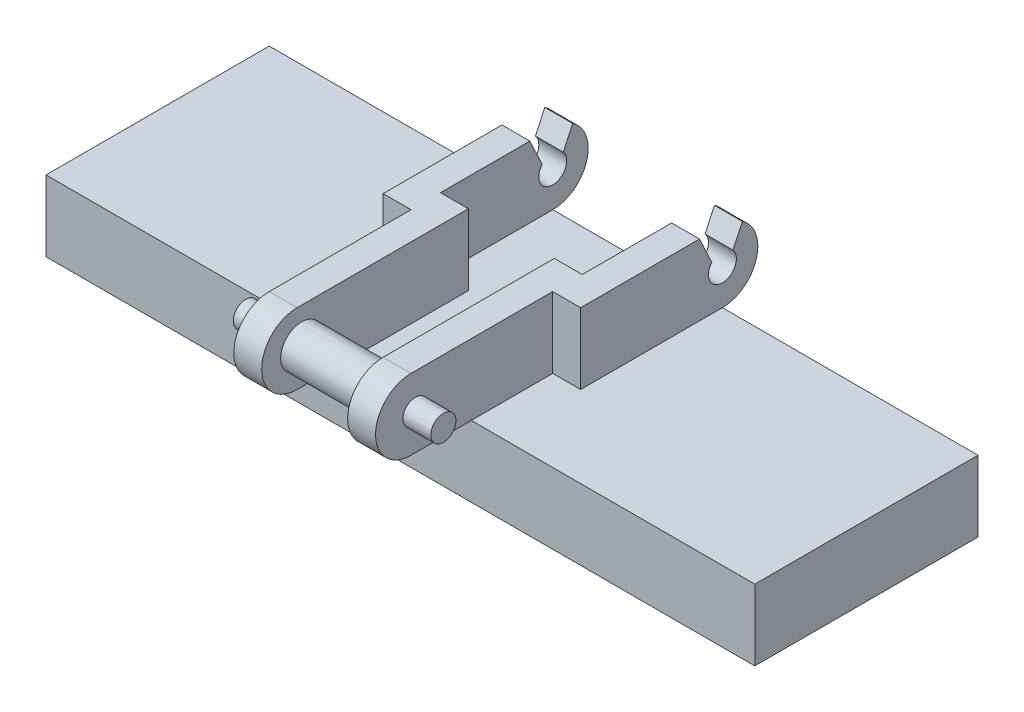
ISO-10303-21;
HEADER;
FILE_DESCRIPTION(('STEP AP214'),'2;1');
FILE_NAME('part.step','',(''),(''),'','','');
FILE_SCHEMA(('AUTOMOTIVE_DESIGN { 1 0 10303 214 1 1 1 1 }'));
ENDSEC;
DATA;
#1=APPLICATION_CONTEXT('core data for automotive mechanical design processes');
#2=APPLICATION_PROTOCOL_DEFINITION('international standard','automotive_design',2000,#1);
#3=PRODUCT_CONTEXT('',#1,'mechanical');
#4=PRODUCT('Part','Part','',(#3));
#5=PRODUCT_RELATED_PRODUCT_CATEGORY('part','',(#4));
#6=PRODUCT_DEFINITION_FORMATION('','',#4);
#7=PRODUCT_DEFINITION_CONTEXT('part definition',#1,'design');
#8=PRODUCT_DEFINITION('design','',#6,#7);
#9=PRODUCT_DEFINITION_SHAPE('','',#8);
#10=(LENGTH_UNIT() NAMED_UNIT(*) SI_UNIT(.MILLI.,.METRE.));
#11=(NAMED_UNIT(*) PLANE_ANGLE_UNIT() SI_UNIT($,.RADIAN.));
#12=(NAMED_UNIT(*) SI_UNIT($,.STERADIAN.) SOLID_ANGLE_UNIT());
#13=UNCERTAINTY_MEASURE_WITH_UNIT(LENGTH_MEASURE(1.E-05),#10,'distance_accuracy_value','');
#14=(GEOMETRIC_REPRESENTATION_CONTEXT(3) GLOBAL_UNCERTAINTY_ASSIGNED_CONTEXT((#13)) GLOBAL_UNIT_ASSIGNED_CONTEXT((#10,
#11,#12)) REPRESENTATION_CONTEXT('',''));
#15=CARTESIAN_POINT('',(0.,0.,0.));
#16=DIRECTION('',(0.,0.,1.));
#17=DIRECTION('',(1.,0.,0.));
#18=AXIS2_PLACEMENT_3D('',#15,#16,#17);
#19=CARTESIAN_POINT('',(-3.54,5.08,-2.54));
#20=DIRECTION('',(1.,0.,0.));
#21=DIRECTION('',(0.,0.,-1.));
#22=AXIS2_PLACEMENT_3D('',#19,#20,#21);
#23=PLANE('',#22);
#24=DIRECTION('',(0.,0.,1.));
#25=VECTOR('',#24,1.);
#26=CARTESIAN_POINT('',(-3.54,5.08,-2.54));
#27=LINE('',#26,#25);
#28=CARTESIAN_POINT('',(-3.54,5.08,-1.72030075043139));
#29=VERTEX_POINT('',#28);
#30=CARTESIAN_POINT('',(-3.54,5.08,2.54));
#31=VERTEX_POINT('',#30);
#32=EDGE_CURVE('E298',#29,#31,#27,.T.);
#33=ORIENTED_EDGE('',*,*,#32,.F.);
#34=DIRECTION('',(0.,-0.905890563934801,-0.423511848917937));
#35=VECTOR('',#34,1.);
#36=CARTESIAN_POINT('',(-3.54,4.76551796665088,-1.86732388180904));
#37=LINE('',#36,#35);
#38=CARTESIAN_POINT('',(-3.54,4.13655586890109,-2.16136922406353));
#39=VERTEX_POINT('',#38);
#40=EDGE_CURVE('E483',#29,#39,#37,.T.);
#41=ORIENTED_EDGE('',*,*,#40,.T.);
#42=CARTESIAN_POINT('',(-3.54,3.81,-2.54));
#43=DIRECTION('',(1.,0.,0.));
#44=DIRECTION('',(0.,0.,-1.));
#45=AXIS2_PLACEMENT_3D('',#42,#43,#44);
#46=CIRCLE('',#45,0.5);
#47=CARTESIAN_POINT('',(-3.54,4.13655586890108,-2.91863077593648));
#48=VERTEX_POINT('',#47);
#49=EDGE_CURVE('E503',#39,#48,#46,.T.);
#50=ORIENTED_EDGE('',*,*,#49,.T.);
#51=DIRECTION('',(0.,0.905890563934803,-0.423511848917932));
#52=VECTOR('',#51,1.);
#53=CARTESIAN_POINT('',(-3.54,4.76551796665089,-3.21267611819097));
#54=LINE('',#53,#52);
#55=CARTESIAN_POINT('',(-3.54,4.85874670048721,-3.25626137562847));
#56=VERTEX_POINT('',#55);
#57=EDGE_CURVE('E491',#48,#56,#54,.T.);
#58=ORIENTED_EDGE('',*,*,#57,.T.);
#59=CARTESIAN_POINT('',(-3.54,3.81,-2.54));
#60=DIRECTION('',(1.,0.,0.));
#61=DIRECTION('',(0.,0.,-1.));
#62=AXIS2_PLACEMENT_3D('',#59,#60,#61);
#63=CIRCLE('',#62,1.27);
#64=CARTESIAN_POINT('',(-3.54,2.54,-2.54));
#65=VERTEX_POINT('',#64);
#66=EDGE_CURVE('E283',#65,#56,#63,.T.);
#67=ORIENTED_EDGE('',*,*,#66,.F.);
#68=DIRECTION('',(0.,0.,1.));
#69=VECTOR('',#68,1.);
#70=CARTESIAN_POINT('',(-3.54,2.54,-2.54));
#71=LINE('',#70,#69);
#72=CARTESIAN_POINT('',(-3.54,2.54,2.54));
#73=VERTEX_POINT('',#72);
#74=EDGE_CURVE('E297',#65,#73,#71,.T.);
#75=ORIENTED_EDGE('',*,*,#74,.T.);
#76=DIRECTION('',(0.,-1.,0.));
#77=VECTOR('',#76,1.);
#78=CARTESIAN_POINT('',(-3.54,5.08,2.54));
#79=LINE('',#78,#77);
#80=EDGE_CURVE('E340',#31,#73,#79,.T.);
#81=ORIENTED_EDGE('',*,*,#80,.F.);
#82=EDGE_LOOP('',(#33,#41,#50,#58,#67,#75,#81));
#83=FACE_BOUND('',#82,.T.);
#84=ADVANCED_FACE('F36',(#83),#23,.F.);
#85=CARTESIAN_POINT('',(-2.54,5.08,1.48274251366495));
#86=DIRECTION('',(-1.,0.,0.));
#87=DIRECTION('',(0.,0.,1.));
#88=AXIS2_PLACEMENT_3D('',#85,#86,#87);
#89=PLANE('',#88);
#90=DIRECTION('',(0.,0.905890563934801,0.423511848917937));
#91=VECTOR('',#90,1.);
#92=CARTESIAN_POINT('',(-2.54,6.30886480514449,-1.1457955878692));
#93=LINE('',#92,#91);
#94=CARTESIAN_POINT('',(-2.54,4.13655586890109,-2.16136922406353));
#95=VERTEX_POINT('',#94);
#96=CARTESIAN_POINT('',(-2.54,5.08,-1.72030075043139));
#97=VERTEX_POINT('',#96);
#98=EDGE_CURVE('E479',#95,#97,#93,.T.);
#99=ORIENTED_EDGE('',*,*,#98,.T.);
#100=DIRECTION('',(0.,0.,-1.));
#101=VECTOR('',#100,1.);
#102=CARTESIAN_POINT('',(-2.54,5.08,1.48274251366495));
#103=LINE('',#102,#101);
#104=CARTESIAN_POINT('',(-2.54,5.08,1.48274251366495));
#105=VERTEX_POINT('',#104);
#106=EDGE_CURVE('E313',#105,#97,#103,.T.);
#107=ORIENTED_EDGE('',*,*,#106,.F.);
#108=DIRECTION('',(0.,-1.,0.));
#109=VECTOR('',#108,1.);
#110=CARTESIAN_POINT('',(-2.54,5.08,1.48274251366495));
#111=LINE('',#110,#109);
#112=CARTESIAN_POINT('',(-2.54,2.54,1.48274251366495));
#113=VERTEX_POINT('',#112);
#114=EDGE_CURVE('E316',#105,#113,#111,.T.);
#115=ORIENTED_EDGE('',*,*,#114,.T.);
#116=DIRECTION('',(0.,0.,-1.));
#117=VECTOR('',#116,1.);
#118=CARTESIAN_POINT('',(-2.54,2.54,1.48274251366495));
#119=LINE('',#118,#117);
#120=CARTESIAN_POINT('',(-2.54,2.54,-2.54));
#121=VERTEX_POINT('',#120);
#122=EDGE_CURVE('E301',#113,#121,#119,.T.);
#123=ORIENTED_EDGE('',*,*,#122,.T.);
#124=CARTESIAN_POINT('',(-2.54,3.81,-2.54));
#125=DIRECTION('',(-1.,0.,0.));
#126=DIRECTION('',(0.,0.,1.));
#127=AXIS2_PLACEMENT_3D('',#124,#125,#126);
#128=CIRCLE('',#127,1.27);
#129=CARTESIAN_POINT('',(-2.54,4.85874670048721,-3.25626137562847));
#130=VERTEX_POINT('',#129);
#131=EDGE_CURVE('E282',#130,#121,#128,.T.);
#132=ORIENTED_EDGE('',*,*,#131,.F.);
#133=DIRECTION('',(0.,-0.905890563934803,0.423511848917932));
#134=VECTOR('',#133,1.);
#135=CARTESIAN_POINT('',(-2.54,3.22217112815729,-2.49114782425114));
#136=LINE('',#135,#134);
#137=CARTESIAN_POINT('',(-2.54,4.13655586890108,-2.91863077593648));
#138=VERTEX_POINT('',#137);
#139=EDGE_CURVE('E488',#130,#138,#136,.T.);
#140=ORIENTED_EDGE('',*,*,#139,.T.);
#141=CARTESIAN_POINT('',(-2.54,3.81,-2.54));
#142=DIRECTION('',(-1.,0.,0.));
#143=DIRECTION('',(0.,0.,1.));
#144=AXIS2_PLACEMENT_3D('',#141,#142,#143);
#145=CIRCLE('',#144,0.5);
#146=EDGE_CURVE('E501',#138,#95,#145,.T.);
#147=ORIENTED_EDGE('',*,*,#146,.T.);
#148=EDGE_LOOP('',(#99,#107,#115,#123,#132,#140,#147));
#149=FACE_BOUND('',#148,.T.);
#150=ADVANCED_FACE('F550',(#149),#89,.F.);
#151=CARTESIAN_POINT('',(0.,5.08,0.));
#152=DIRECTION('',(0.,1.,0.));
#153=DIRECTION('',(0.,0.,1.));
#154=AXIS2_PLACEMENT_3D('',#151,#152,#153);
#155=PLANE('',#154);
#156=ORIENTED_EDGE('',*,*,#106,.T.);
#157=DIRECTION('',(1.,0.,0.));
#158=VECTOR('',#157,1.);
#159=CARTESIAN_POINT('',(-5.46,5.08,-1.72030075043139));
#160=LINE('',#159,#158);
#161=EDGE_CURVE('E241',#29,#97,#160,.T.);
#162=ORIENTED_EDGE('',*,*,#161,.F.);
#163=ORIENTED_EDGE('',*,*,#32,.T.);
#164=DIRECTION('',(1.,0.,0.));
#165=VECTOR('',#164,1.);
#166=CARTESIAN_POINT('',(-3.54,5.08,2.54));
#167=LINE('',#166,#165);
#168=CARTESIAN_POINT('',(-2.54,5.08,2.54));
#169=VERTEX_POINT('',#168);
#170=EDGE_CURVE('E300',#31,#169,#167,.T.);
#171=ORIENTED_EDGE('',*,*,#170,.T.);
#172=DIRECTION('',(0.,0.,1.));
#173=VECTOR('',#172,1.);
#174=CARTESIAN_POINT('',(-2.54,5.08,2.54));
#175=LINE('',#174,#173);
#176=CARTESIAN_POINT('',(-2.54,5.08,7.62));
#177=VERTEX_POINT('',#176);
#178=EDGE_CURVE('E303',#169,#177,#175,.T.);
#179=ORIENTED_EDGE('',*,*,#178,.T.);
#180=DIRECTION('',(1.,0.,0.));
#181=VECTOR('',#180,1.);
#182=CARTESIAN_POINT('',(-2.54,5.08,7.62));
#183=LINE('',#182,#181);
#184=CARTESIAN_POINT('',(-1.54,5.08,7.62));
#185=VERTEX_POINT('',#184);
#186=EDGE_CURVE('E306',#177,#185,#183,.T.);
#187=ORIENTED_EDGE('',*,*,#186,.T.);
#188=DIRECTION('',(0.,0.,-1.));
#189=VECTOR('',#188,1.);
#190=CARTESIAN_POINT('',(-1.54,5.08,7.62));
#191=LINE('',#190,#189);
#192=CARTESIAN_POINT('',(-1.54,5.08,1.48274251366495));
#193=VERTEX_POINT('',#192);
#194=EDGE_CURVE('E309',#185,#193,#191,.T.);
#195=ORIENTED_EDGE('',*,*,#194,.T.);
#196=DIRECTION('',(-1.,0.,0.));
#197=VECTOR('',#196,1.);
#198=CARTESIAN_POINT('',(-1.54,5.08,1.48274251366495));
#199=LINE('',#198,#197);
#200=EDGE_CURVE('E311',#193,#105,#199,.T.);
#201=ORIENTED_EDGE('',*,*,#200,.T.);
#202=EDGE_LOOP('',(#156,#162,#163,#171,#179,#187,#195,#201));
#203=FACE_BOUND('',#202,.T.);
#204=ADVANCED_FACE('F386',(#203),#155,.T.);
#205=CARTESIAN_POINT('',(2.54,5.08,1.48274251366495));
#206=DIRECTION('',(-1.,0.,0.));
#207=DIRECTION('',(0.,0.,1.));
#208=AXIS2_PLACEMENT_3D('',#205,#206,#207);
#209=PLANE('',#208);
#210=DIRECTION('',(0.,0.,-1.));
#211=VECTOR('',#210,1.);
#212=CARTESIAN_POINT('',(2.54,5.08,1.48274251366495));
#213=LINE('',#212,#211);
#214=CARTESIAN_POINT('',(2.54,5.08,1.48274251366495));
#215=VERTEX_POINT('',#214);
#216=CARTESIAN_POINT('',(2.54,5.08,-1.72030075043139));
#217=VERTEX_POINT('',#216);
#218=EDGE_CURVE('E273',#215,#217,#213,.T.);
#219=ORIENTED_EDGE('',*,*,#218,.T.);
#220=DIRECTION('',(0.,0.905890563934801,0.423511848917937));
#221=VECTOR('',#220,1.);
#222=CARTESIAN_POINT('',(2.54,6.30886480514449,-1.1457955878692));
#223=LINE('',#222,#221);
#224=CARTESIAN_POINT('',(2.54,4.13655586890109,-2.16136922406353));
#225=VERTEX_POINT('',#224);
#226=EDGE_CURVE('E237',#225,#217,#223,.T.);
#227=ORIENTED_EDGE('',*,*,#226,.F.);
#228=CARTESIAN_POINT('',(2.54,3.81,-2.54));
#229=DIRECTION('',(-1.,0.,0.));
#230=DIRECTION('',(0.,0.,1.));
#231=AXIS2_PLACEMENT_3D('',#228,#229,#230);
#232=CIRCLE('',#231,0.5);
#233=CARTESIAN_POINT('',(2.54,4.13655586890108,-2.91863077593648));
#234=VERTEX_POINT('',#233);
#235=EDGE_CURVE('E498',#234,#225,#232,.T.);
#236=ORIENTED_EDGE('',*,*,#235,.F.);
#237=DIRECTION('',(0.,-0.905890563934803,0.423511848917932));
#238=VECTOR('',#237,1.);
#239=CARTESIAN_POINT('',(2.54,3.22217112815729,-2.49114782425114));
#240=LINE('',#239,#238);
#241=CARTESIAN_POINT('',(2.54,4.85874670048721,-3.25626137562847));
#242=VERTEX_POINT('',#241);
#243=EDGE_CURVE('E61',#242,#234,#240,.T.);
#244=ORIENTED_EDGE('',*,*,#243,.F.);
#245=CARTESIAN_POINT('',(2.54,3.81,-2.54));
#246=DIRECTION('',(-1.,0.,0.));
#247=DIRECTION('',(0.,0.,1.));
#248=AXIS2_PLACEMENT_3D('',#245,#246,#247);
#249=CIRCLE('',#248,1.27);
#250=CARTESIAN_POINT('',(2.54,2.54,-2.54));
#251=VERTEX_POINT('',#250);
#252=EDGE_CURVE('E434',#242,#251,#249,.T.);
#253=ORIENTED_EDGE('',*,*,#252,.T.);
#254=DIRECTION('',(0.,0.,-1.));
#255=VECTOR('',#254,1.);
#256=CARTESIAN_POINT('',(2.54,2.54,1.48274251366495));
#257=LINE('',#256,#255);
#258=CARTESIAN_POINT('',(2.54,2.54,1.48274251366495));
#259=VERTEX_POINT('',#258);
#260=EDGE_CURVE('E256',#259,#251,#257,.T.);
#261=ORIENTED_EDGE('',*,*,#260,.F.);
#262=DIRECTION('',(0.,-1.,0.));
#263=VECTOR('',#262,1.);
#264=CARTESIAN_POINT('',(2.54,5.08,1.48274251366495));
#265=LINE('',#264,#263);
#266=EDGE_CURVE('E279',#215,#259,#265,.T.);
#267=ORIENTED_EDGE('',*,*,#266,.F.);
#268=EDGE_LOOP('',(#219,#227,#236,#244,#253,#261,#267));
#269=FACE_BOUND('',#268,.T.);
#270=ADVANCED_FACE('F615',(#269),#209,.T.);
#271=CARTESIAN_POINT('',(3.54,5.08,-2.54));
#272=DIRECTION('',(1.,0.,0.));
#273=DIRECTION('',(0.,0.,-1.));
#274=AXIS2_PLACEMENT_3D('',#271,#272,#273);
#275=PLANE('',#274);
#276=DIRECTION('',(0.,-0.905890563934801,-0.423511848917937));
#277=VECTOR('',#276,1.);
#278=CARTESIAN_POINT('',(3.54,5.08,-1.72030075043139));
#279=LINE('',#278,#277);
#280=CARTESIAN_POINT('',(3.54,5.08,-1.72030075043139));
#281=VERTEX_POINT('',#280);
#282=CARTESIAN_POINT('',(3.54,4.13655586890109,-2.16136922406353));
#283=VERTEX_POINT('',#282);
#284=EDGE_CURVE('E53',#281,#283,#279,.T.);
#285=ORIENTED_EDGE('',*,*,#284,.F.);
#286=DIRECTION('',(0.,0.,1.));
#287=VECTOR('',#286,1.);
#288=CARTESIAN_POINT('',(3.54,5.08,-2.54));
#289=LINE('',#288,#287);
#290=CARTESIAN_POINT('',(3.54,5.08,2.54));
#291=VERTEX_POINT('',#290);
#292=EDGE_CURVE('E225',#281,#291,#289,.T.);
#293=ORIENTED_EDGE('',*,*,#292,.T.);
#294=DIRECTION('',(0.,-1.,0.));
#295=VECTOR('',#294,1.);
#296=CARTESIAN_POINT('',(3.54,5.08,2.54));
#297=LINE('',#296,#295);
#298=CARTESIAN_POINT('',(3.54,2.54,2.54));
#299=VERTEX_POINT('',#298);
#300=EDGE_CURVE('E248',#291,#299,#297,.T.);
#301=ORIENTED_EDGE('',*,*,#300,.T.);
#302=DIRECTION('',(0.,0.,1.));
#303=VECTOR('',#302,1.);
#304=CARTESIAN_POINT('',(3.54,2.54,-2.54));
#305=LINE('',#304,#303);
#306=CARTESIAN_POINT('',(3.54,2.54,-2.54));
#307=VERTEX_POINT('',#306);
#308=EDGE_CURVE('E272',#307,#299,#305,.T.);
#309=ORIENTED_EDGE('',*,*,#308,.F.);
#310=CARTESIAN_POINT('',(3.54,3.81,-2.54));
#311=DIRECTION('',(-1.,0.,0.));
#312=DIRECTION('',(0.,0.,1.));
#313=AXIS2_PLACEMENT_3D('',#310,#311,#312);
#314=CIRCLE('',#313,1.27);
#315=CARTESIAN_POINT('',(3.54,4.85874670048721,-3.25626137562847));
#316=VERTEX_POINT('',#315);
#317=EDGE_CURVE('E429',#307,#316,#314,.F.);
#318=ORIENTED_EDGE('',*,*,#317,.T.);
#319=DIRECTION('',(0.,0.905890563934802,-0.423511848917932));
#320=VECTOR('',#319,1.);
#321=CARTESIAN_POINT('',(3.54,4.85874670048721,-3.25626137562847));
#322=LINE('',#321,#320);
#323=CARTESIAN_POINT('',(3.54,4.13655586890108,-2.91863077593648));
#324=VERTEX_POINT('',#323);
#325=EDGE_CURVE('E230',#324,#316,#322,.T.);
#326=ORIENTED_EDGE('',*,*,#325,.F.);
#327=CARTESIAN_POINT('',(3.54,3.81,-2.54));
#328=DIRECTION('',(1.,0.,0.));
#329=DIRECTION('',(0.,0.,-1.));
#330=AXIS2_PLACEMENT_3D('',#327,#328,#329);
#331=CIRCLE('',#330,0.5);
#332=EDGE_CURVE('E229',#283,#324,#331,.T.);
#333=ORIENTED_EDGE('',*,*,#332,.F.);
#334=EDGE_LOOP('',(#285,#293,#301,#309,#318,#326,#333));
#335=FACE_BOUND('',#334,.T.);
#336=ADVANCED_FACE('F222',(#335),#275,.T.);
#337=CARTESIAN_POINT('',(0.,5.08,0.));
#338=DIRECTION('',(0.,1.,0.));
#339=DIRECTION('',(0.,0.,1.));
#340=AXIS2_PLACEMENT_3D('',#337,#338,#339);
#341=PLANE('',#340);
#342=ORIENTED_EDGE('',*,*,#292,.F.);
#343=EDGE_CURVE('E234',#217,#281,#160,.T.);
#344=ORIENTED_EDGE('',*,*,#343,.F.);
#345=ORIENTED_EDGE('',*,*,#218,.F.);
#346=DIRECTION('',(1.,0.,0.));
#347=VECTOR('',#346,1.);
#348=CARTESIAN_POINT('',(1.54,5.08,1.48274251366495));
#349=LINE('',#348,#347);
#350=CARTESIAN_POINT('',(1.54,5.08,1.48274251366495));
#351=VERTEX_POINT('',#350);
#352=EDGE_CURVE('E444',#351,#215,#349,.T.);
#353=ORIENTED_EDGE('',*,*,#352,.F.);
#354=DIRECTION('',(0.,0.,-1.));
#355=VECTOR('',#354,1.);
#356=CARTESIAN_POINT('',(1.54,5.08,7.62));
#357=LINE('',#356,#355);
#358=CARTESIAN_POINT('',(1.54,5.08,7.62));
#359=VERTEX_POINT('',#358);
#360=EDGE_CURVE('E447',#359,#351,#357,.T.);
#361=ORIENTED_EDGE('',*,*,#360,.F.);
#362=DIRECTION('',(-1.,0.,0.));
#363=VECTOR('',#362,1.);
#364=CARTESIAN_POINT('',(2.54,5.08,7.62));
#365=LINE('',#364,#363);
#366=CARTESIAN_POINT('',(2.54,5.08,7.62));
#367=VERTEX_POINT('',#366);
#368=EDGE_CURVE('E450',#367,#359,#365,.T.);
#369=ORIENTED_EDGE('',*,*,#368,.F.);
#370=DIRECTION('',(0.,0.,1.));
#371=VECTOR('',#370,1.);
#372=CARTESIAN_POINT('',(2.54,5.08,2.54));
#373=LINE('',#372,#371);
#374=CARTESIAN_POINT('',(2.54,5.08,2.54));
#375=VERTEX_POINT('',#374);
#376=EDGE_CURVE('E252',#375,#367,#373,.T.);
#377=ORIENTED_EDGE('',*,*,#376,.F.);
#378=DIRECTION('',(-1.,0.,0.));
#379=VECTOR('',#378,1.);
#380=CARTESIAN_POINT('',(3.54,5.08,2.54));
#381=LINE('',#380,#379);
#382=EDGE_CURVE('E247',#291,#375,#381,.T.);
#383=ORIENTED_EDGE('',*,*,#382,.F.);
#384=EDGE_LOOP('',(#342,#344,#345,#353,#361,#369,#377,#383));
#385=FACE_BOUND('',#384,.T.);
#386=ADVANCED_FACE('F244',(#385),#341,.T.);
#387=CARTESIAN_POINT('',(-7.,5.08,-1.72030075043139));
#388=DIRECTION('',(0.,-0.423511848917937,0.905890563934801));
#389=DIRECTION('',(0.,-0.905890563934801,-0.423511848917937));
#390=AXIS2_PLACEMENT_3D('',#387,#388,#389);
#391=PLANE('',#390);
#392=ORIENTED_EDGE('',*,*,#226,.T.);
#393=ORIENTED_EDGE('',*,*,#343,.T.);
#394=ORIENTED_EDGE('',*,*,#284,.T.);
#395=DIRECTION('',(1.,0.,0.));
#396=VECTOR('',#395,1.);
#397=CARTESIAN_POINT('',(-12.7,4.13655586890109,-2.16136922406353));
#398=LINE('',#397,#396);
#399=EDGE_CURVE('E485',#225,#283,#398,.T.);
#400=ORIENTED_EDGE('',*,*,#399,.F.);
#401=EDGE_LOOP('',(#392,#393,#394,#400));
#402=FACE_BOUND('',#401,.T.);
#403=ADVANCED_FACE('F235',(#402),#391,.F.);
#404=CARTESIAN_POINT('',(-12.7,2.54,2.54));
#405=DIRECTION('',(0.,0.,-1.));
#406=DIRECTION('',(-1.,0.,0.));
#407=AXIS2_PLACEMENT_3D('',#404,#405,#406);
#408=PLANE('',#407);
#409=DIRECTION('',(-1.,0.,0.));
#410=VECTOR('',#409,1.);
#411=CARTESIAN_POINT('',(-12.7,2.54,2.54));
#412=LINE('',#411,#410);
#413=CARTESIAN_POINT('',(2.54,2.54,2.54));
#414=VERTEX_POINT('',#413);
#415=EDGE_CURVE('E425',#299,#414,#412,.T.);
#416=ORIENTED_EDGE('',*,*,#415,.F.);
#417=ORIENTED_EDGE('',*,*,#300,.F.);
#418=ORIENTED_EDGE('',*,*,#382,.T.);
#419=DIRECTION('',(0.,-1.,0.));
#420=VECTOR('',#419,1.);
#421=CARTESIAN_POINT('',(2.54,5.08,2.54));
#422=LINE('',#421,#420);
#423=EDGE_CURVE('E250',#375,#414,#422,.T.);
#424=ORIENTED_EDGE('',*,*,#423,.T.);
#425=EDGE_LOOP('',(#416,#417,#418,#424));
#426=FACE_BOUND('',#425,.T.);
#427=ADVANCED_FACE('F469',(#426),#408,.F.);
#428=CARTESIAN_POINT('',(-2.54,2.54,2.54));
#429=VERTEX_POINT('',#428);
#430=EDGE_CURVE('E428',#429,#73,#412,.T.);
#431=ORIENTED_EDGE('',*,*,#430,.F.);
#432=DIRECTION('',(0.,-1.,0.));
#433=VECTOR('',#432,1.);
#434=CARTESIAN_POINT('',(-2.54,5.08,2.54));
#435=LINE('',#434,#433);
#436=EDGE_CURVE('E337',#169,#429,#435,.T.);
#437=ORIENTED_EDGE('',*,*,#436,.F.);
#438=ORIENTED_EDGE('',*,*,#170,.F.);
#439=ORIENTED_EDGE('',*,*,#80,.T.);
#440=EDGE_LOOP('',(#431,#437,#438,#439));
#441=FACE_BOUND('',#440,.T.);
#442=ADVANCED_FACE('F536',(#441),#408,.F.);
#443=CARTESIAN_POINT('',(0.,2.54,0.));
#444=DIRECTION('',(0.,1.,0.));
#445=DIRECTION('',(0.,0.,1.));
#446=AXIS2_PLACEMENT_3D('',#443,#444,#445);
#447=PLANE('',#446);
#448=DIRECTION('',(-1.,0.,0.));
#449=VECTOR('',#448,1.);
#450=CARTESIAN_POINT('',(12.7,2.54,5.46));
#451=LINE('',#450,#449);
#452=CARTESIAN_POINT('',(-1.54,2.54,5.46));
#453=VERTEX_POINT('',#452);
#454=CARTESIAN_POINT('',(-2.54,2.54,5.46));
#455=VERTEX_POINT('',#454);
#456=EDGE_CURVE('E400',#453,#455,#451,.T.);
#457=ORIENTED_EDGE('',*,*,#456,.F.);
#458=DIRECTION('',(0.,0.,-1.));
#459=VECTOR('',#458,1.);
#460=CARTESIAN_POINT('',(-1.54,2.54,7.62));
#461=LINE('',#460,#459);
#462=CARTESIAN_POINT('',(-1.54,2.54,7.62));
#463=VERTEX_POINT('',#462);
#464=EDGE_CURVE('E324',#463,#453,#461,.T.);
#465=ORIENTED_EDGE('',*,*,#464,.F.);
#466=DIRECTION('',(1.,0.,0.));
#467=VECTOR('',#466,1.);
#468=CARTESIAN_POINT('',(-2.54,2.54,7.62));
#469=LINE('',#468,#467);
#470=CARTESIAN_POINT('',(-2.54,2.54,7.62));
#471=VERTEX_POINT('',#470);
#472=EDGE_CURVE('E322',#471,#463,#469,.T.);
#473=ORIENTED_EDGE('',*,*,#472,.F.);
#474=DIRECTION('',(0.,0.,1.));
#475=VECTOR('',#474,1.);
#476=CARTESIAN_POINT('',(-2.54,2.54,2.54));
#477=LINE('',#476,#475);
#478=EDGE_CURVE('E318',#455,#471,#477,.T.);
#479=ORIENTED_EDGE('',*,*,#478,.F.);
#480=EDGE_LOOP('',(#457,#465,#473,#479));
#481=FACE_BOUND('',#480,.T.);
#482=ADVANCED_FACE('F398',(#481),#447,.F.);
#483=CARTESIAN_POINT('',(0.,2.54,0.));
#484=DIRECTION('',(0.,1.,0.));
#485=DIRECTION('',(0.,0.,1.));
#486=AXIS2_PLACEMENT_3D('',#483,#484,#485);
#487=PLANE('',#486);
#488=CARTESIAN_POINT('',(2.54,2.54,5.46));
#489=VERTEX_POINT('',#488);
#490=CARTESIAN_POINT('',(1.54,2.54,5.46));
#491=VERTEX_POINT('',#490);
#492=EDGE_CURVE('E410',#489,#491,#451,.T.);
#493=ORIENTED_EDGE('',*,*,#492,.F.);
#494=DIRECTION('',(0.,0.,1.));
#495=VECTOR('',#494,1.);
#496=CARTESIAN_POINT('',(2.54,2.54,2.54));
#497=LINE('',#496,#495);
#498=CARTESIAN_POINT('',(2.54,2.54,7.62));
#499=VERTEX_POINT('',#498);
#500=EDGE_CURVE('E268',#489,#499,#497,.T.);
#501=ORIENTED_EDGE('',*,*,#500,.T.);
#502=DIRECTION('',(-1.,0.,0.));
#503=VECTOR('',#502,1.);
#504=CARTESIAN_POINT('',(2.54,2.54,7.62));
#505=LINE('',#504,#503);
#506=CARTESIAN_POINT('',(1.54,2.54,7.62));
#507=VERTEX_POINT('',#506);
#508=EDGE_CURVE('E265',#499,#507,#505,.T.);
#509=ORIENTED_EDGE('',*,*,#508,.T.);
#510=DIRECTION('',(0.,0.,-1.));
#511=VECTOR('',#510,1.);
#512=CARTESIAN_POINT('',(1.54,2.54,7.62));
#513=LINE('',#512,#511);
#514=EDGE_CURVE('E262',#507,#491,#513,.T.);
#515=ORIENTED_EDGE('',*,*,#514,.T.);
#516=EDGE_LOOP('',(#493,#501,#509,#515));
#517=FACE_BOUND('',#516,.T.);
#518=ADVANCED_FACE('F462',(#517),#487,.F.);
#519=CARTESIAN_POINT('',(0.,2.54,0.));
#520=DIRECTION('',(0.,1.,0.));
#521=DIRECTION('',(0.,0.,1.));
#522=AXIS2_PLACEMENT_3D('',#519,#520,#521);
#523=PLANE('',#522);
#524=ORIENTED_EDGE('',*,*,#260,.T.);
#525=DIRECTION('',(-1.,0.,0.));
#526=VECTOR('',#525,1.);
#527=CARTESIAN_POINT('',(-12.7,2.54,-2.54));
#528=LINE('',#527,#526);
#529=EDGE_CURVE('E354',#251,#121,#528,.T.);
#530=ORIENTED_EDGE('',*,*,#529,.T.);
#531=ORIENTED_EDGE('',*,*,#122,.F.);
#532=DIRECTION('',(-1.,0.,0.));
#533=VECTOR('',#532,1.);
#534=CARTESIAN_POINT('',(-1.54,2.54,1.48274251366495));
#535=LINE('',#534,#533);
#536=CARTESIAN_POINT('',(-1.54,2.54,1.48274251366495));
#537=VERTEX_POINT('',#536);
#538=EDGE_CURVE('E327',#537,#113,#535,.T.);
#539=ORIENTED_EDGE('',*,*,#538,.F.);
#540=EDGE_CURVE('E328',#453,#537,#461,.T.);
#541=ORIENTED_EDGE('',*,*,#540,.F.);
#542=EDGE_CURVE('E405',#491,#453,#451,.T.);
#543=ORIENTED_EDGE('',*,*,#542,.F.);
#544=CARTESIAN_POINT('',(1.54,2.54,1.48274251366495));
#545=VERTEX_POINT('',#544);
#546=EDGE_CURVE('E261',#491,#545,#513,.T.);
#547=ORIENTED_EDGE('',*,*,#546,.T.);
#548=DIRECTION('',(1.,0.,0.));
#549=VECTOR('',#548,1.);
#550=CARTESIAN_POINT('',(1.54,2.54,1.48274251366495));
#551=LINE('',#550,#549);
#552=EDGE_CURVE('E258',#545,#259,#551,.T.);
#553=ORIENTED_EDGE('',*,*,#552,.T.);
#554=EDGE_LOOP('',(#524,#530,#531,#539,#541,#543,#547,#553));
#555=FACE_BOUND('',#554,.T.);
#556=ADVANCED_FACE('F575',(#555),#523,.T.);
#557=CARTESIAN_POINT('',(-12.7,2.54,-2.54));
#558=DIRECTION('',(0.,0.,1.));
#559=DIRECTION('',(1.,0.,0.));
#560=AXIS2_PLACEMENT_3D('',#557,#558,#559);
#561=PLANE('',#560);
#562=ORIENTED_EDGE('',*,*,#529,.F.);
#563=DIRECTION('',(-1.,0.,0.));
#564=VECTOR('',#563,1.);
#565=CARTESIAN_POINT('',(11.4598063314247,2.54,-2.54));
#566=LINE('',#565,#564);
#567=EDGE_CURVE('E433',#307,#251,#566,.T.);
#568=ORIENTED_EDGE('',*,*,#567,.F.);
#569=CARTESIAN_POINT('',(12.7,2.54,-2.54));
#570=VERTEX_POINT('',#569);
#571=EDGE_CURVE('E350',#570,#307,#528,.T.);
#572=ORIENTED_EDGE('',*,*,#571,.F.);
#573=DIRECTION('',(0.,-1.,0.));
#574=VECTOR('',#573,1.);
#575=CARTESIAN_POINT('',(12.7,2.54,-2.54));
#576=LINE('',#575,#574);
#577=CARTESIAN_POINT('',(12.7,0.,-2.54));
#578=VERTEX_POINT('',#577);
#579=EDGE_CURVE('E361',#570,#578,#576,.T.);
#580=ORIENTED_EDGE('',*,*,#579,.T.);
#581=DIRECTION('',(-1.,0.,0.));
#582=VECTOR('',#581,1.);
#583=CARTESIAN_POINT('',(-12.7,0.,-2.54));
#584=LINE('',#583,#582);
#585=CARTESIAN_POINT('',(-12.7,0.,-2.54));
#586=VERTEX_POINT('',#585);
#587=EDGE_CURVE('E347',#578,#586,#584,.T.);
#588=ORIENTED_EDGE('',*,*,#587,.T.);
#589=DIRECTION('',(0.,-1.,0.));
#590=VECTOR('',#589,1.);
#591=CARTESIAN_POINT('',(-12.7,2.54,-2.54));
#592=LINE('',#591,#590);
#593=CARTESIAN_POINT('',(-12.7,2.54,-2.54));
#594=VERTEX_POINT('',#593);
#595=EDGE_CURVE('E353',#594,#586,#592,.T.);
#596=ORIENTED_EDGE('',*,*,#595,.F.);
#597=EDGE_CURVE('E349',#65,#594,#528,.T.);
#598=ORIENTED_EDGE('',*,*,#597,.F.);
#599=DIRECTION('',(1.,0.,0.));
#600=VECTOR('',#599,1.);
#601=CARTESIAN_POINT('',(-6.37980633142473,2.54,-2.54));
#602=LINE('',#601,#600);
#603=EDGE_CURVE('E287',#65,#121,#602,.T.);
#604=ORIENTED_EDGE('',*,*,#603,.T.);
#605=EDGE_LOOP('',(#562,#568,#572,#580,#588,#596,#598,#604));
#606=FACE_BOUND('',#605,.T.);
#607=ADVANCED_FACE('F525',(#606),#561,.F.);
#608=ORIENTED_EDGE('',*,*,#308,.T.);
#609=ORIENTED_EDGE('',*,*,#415,.T.);
#610=EDGE_CURVE('E269',#414,#489,#497,.T.);
#611=ORIENTED_EDGE('',*,*,#610,.T.);
#612=CARTESIAN_POINT('',(12.7,2.54,5.46));
#613=VERTEX_POINT('',#612);
#614=EDGE_CURVE('E413',#613,#489,#451,.T.);
#615=ORIENTED_EDGE('',*,*,#614,.F.);
#616=DIRECTION('',(0.,0.,-1.));
#617=VECTOR('',#616,1.);
#618=CARTESIAN_POINT('',(12.7,2.54,-2.54));
#619=LINE('',#618,#617);
#620=EDGE_CURVE('E346',#613,#570,#619,.T.);
#621=ORIENTED_EDGE('',*,*,#620,.T.);
#622=ORIENTED_EDGE('',*,*,#571,.T.);
#623=EDGE_LOOP('',(#608,#609,#611,#615,#621,#622));
#624=FACE_BOUND('',#623,.T.);
#625=ADVANCED_FACE('F466',(#624),#523,.T.);
#626=CARTESIAN_POINT('',(-12.7,2.54,-2.54));
#627=DIRECTION('',(1.,0.,0.));
#628=DIRECTION('',(0.,0.,-1.));
#629=AXIS2_PLACEMENT_3D('',#626,#627,#628);
#630=PLANE('',#629);
#631=DIRECTION('',(0.,0.,1.));
#632=VECTOR('',#631,1.);
#633=CARTESIAN_POINT('',(-12.7,0.,-2.54));
#634=LINE('',#633,#632);
#635=CARTESIAN_POINT('',(-12.7,0.,5.46));
#636=VERTEX_POINT('',#635);
#637=EDGE_CURVE('E343',#586,#636,#634,.T.);
#638=ORIENTED_EDGE('',*,*,#637,.T.);
#639=DIRECTION('',(0.,1.,0.));
#640=VECTOR('',#639,1.);
#641=CARTESIAN_POINT('',(-12.7,0.,5.46));
#642=LINE('',#641,#640);
#643=CARTESIAN_POINT('',(-12.7,2.54,5.46));
#644=VERTEX_POINT('',#643);
#645=EDGE_CURVE('E419',#636,#644,#642,.T.);
#646=ORIENTED_EDGE('',*,*,#645,.T.);
#647=DIRECTION('',(0.,0.,1.));
#648=VECTOR('',#647,1.);
#649=CARTESIAN_POINT('',(-12.7,2.54,-2.54));
#650=LINE('',#649,#648);
#651=EDGE_CURVE('E344',#594,#644,#650,.T.);
#652=ORIENTED_EDGE('',*,*,#651,.F.);
#653=ORIENTED_EDGE('',*,*,#595,.T.);
#654=EDGE_LOOP('',(#638,#646,#652,#653));
#655=FACE_BOUND('',#654,.T.);
#656=ADVANCED_FACE('F38',(#655),#630,.F.);
#657=CARTESIAN_POINT('',(12.7,2.54,-2.54));
#658=DIRECTION('',(-1.,0.,0.));
#659=DIRECTION('',(0.,0.,1.));
#660=AXIS2_PLACEMENT_3D('',#657,#658,#659);
#661=PLANE('',#660);
#662=DIRECTION('',(0.,0.,-1.));
#663=VECTOR('',#662,1.);
#664=CARTESIAN_POINT('',(12.7,0.,-2.54));
#665=LINE('',#664,#663);
#666=CARTESIAN_POINT('',(12.7,0.,5.46));
#667=VERTEX_POINT('',#666);
#668=EDGE_CURVE('E356',#667,#578,#665,.T.);
#669=ORIENTED_EDGE('',*,*,#668,.T.);
#670=ORIENTED_EDGE('',*,*,#579,.F.);
#671=ORIENTED_EDGE('',*,*,#620,.F.);
#672=DIRECTION('',(0.,1.,0.));
#673=VECTOR('',#672,1.);
#674=CARTESIAN_POINT('',(12.7,0.,5.46));
#675=LINE('',#674,#673);
#676=EDGE_CURVE('E422',#667,#613,#675,.T.);
#677=ORIENTED_EDGE('',*,*,#676,.F.);
#678=EDGE_LOOP('',(#669,#670,#671,#677));
#679=FACE_BOUND('',#678,.T.);
#680=ADVANCED_FACE('F520',(#679),#661,.F.);
#681=ORIENTED_EDGE('',*,*,#74,.F.);
#682=ORIENTED_EDGE('',*,*,#597,.T.);
#683=ORIENTED_EDGE('',*,*,#651,.T.);
#684=EDGE_CURVE('E414',#455,#644,#451,.T.);
#685=ORIENTED_EDGE('',*,*,#684,.F.);
#686=EDGE_CURVE('E319',#429,#455,#477,.T.);
#687=ORIENTED_EDGE('',*,*,#686,.F.);
#688=ORIENTED_EDGE('',*,*,#430,.T.);
#689=EDGE_LOOP('',(#681,#682,#683,#685,#687,#688));
#690=FACE_BOUND('',#689,.T.);
#691=ADVANCED_FACE('F530',(#690),#523,.T.);
#692=CARTESIAN_POINT('',(0.,0.,0.));
#693=DIRECTION('',(0.,1.,0.));
#694=DIRECTION('',(0.,0.,1.));
#695=AXIS2_PLACEMENT_3D('',#692,#693,#694);
#696=PLANE('',#695);
#697=ORIENTED_EDGE('',*,*,#637,.F.);
#698=ORIENTED_EDGE('',*,*,#587,.F.);
#699=ORIENTED_EDGE('',*,*,#668,.F.);
#700=DIRECTION('',(-1.,0.,0.));
#701=VECTOR('',#700,1.);
#702=CARTESIAN_POINT('',(12.7,0.,5.46));
#703=LINE('',#702,#701);
#704=EDGE_CURVE('E417',#667,#636,#703,.T.);
#705=ORIENTED_EDGE('',*,*,#704,.T.);
#706=EDGE_LOOP('',(#697,#698,#699,#705));
#707=FACE_BOUND('',#706,.T.);
#708=ADVANCED_FACE('F517',(#707),#696,.F.);
#709=CARTESIAN_POINT('',(-2.54,5.08,2.54));
#710=DIRECTION('',(1.,0.,0.));
#711=DIRECTION('',(0.,0.,-1.));
#712=AXIS2_PLACEMENT_3D('',#709,#710,#711);
#713=PLANE('',#712);
#714=CARTESIAN_POINT('',(-2.54,3.81,7.46));
#715=DIRECTION('',(1.,0.,0.));
#716=DIRECTION('',(0.,0.,-1.));
#717=AXIS2_PLACEMENT_3D('',#714,#715,#716);
#718=CIRCLE('',#717,0.45);
#719=CARTESIAN_POINT('',(-2.54,3.81,7.01));
#720=VERTEX_POINT('',#719);
#721=EDGE_CURVE('E11',#720,#720,#718,.F.);
#722=ORIENTED_EDGE('',*,*,#721,.F.);
#723=EDGE_LOOP('',(#722));
#724=FACE_BOUND('',#723,.T.);
#725=ORIENTED_EDGE('',*,*,#686,.T.);
#726=ORIENTED_EDGE('',*,*,#478,.T.);
#727=CARTESIAN_POINT('',(-2.54,3.81,7.62));
#728=DIRECTION('',(1.,0.,0.));
#729=DIRECTION('',(0.,0.,-1.));
#730=AXIS2_PLACEMENT_3D('',#727,#728,#729);
#731=CIRCLE('',#730,1.27);
#732=EDGE_CURVE('E294',#471,#177,#731,.F.);
#733=ORIENTED_EDGE('',*,*,#732,.T.);
#734=ORIENTED_EDGE('',*,*,#178,.F.);
#735=ORIENTED_EDGE('',*,*,#436,.T.);
#736=EDGE_LOOP('',(#725,#726,#733,#734,#735));
#737=FACE_BOUND('',#736,.T.);
#738=ADVANCED_FACE('F378',(#724,#737),#713,.F.);
#739=CARTESIAN_POINT('',(-1.54,5.08,7.62));
#740=DIRECTION('',(-1.,0.,0.));
#741=DIRECTION('',(0.,0.,1.));
#742=AXIS2_PLACEMENT_3D('',#739,#740,#741);
#743=PLANE('',#742);
#744=CARTESIAN_POINT('',(-1.54,3.81,7.46));
#745=DIRECTION('',(-1.,0.,0.));
#746=DIRECTION('',(0.,0.,1.));
#747=AXIS2_PLACEMENT_3D('',#744,#745,#746);
#748=CIRCLE('',#747,0.75);
#749=CARTESIAN_POINT('',(-1.54,3.81,8.21));
#750=VERTEX_POINT('',#749);
#751=EDGE_CURVE('E45',#750,#750,#748,.F.);
#752=ORIENTED_EDGE('',*,*,#751,.F.);
#753=EDGE_LOOP('',(#752));
#754=FACE_BOUND('',#753,.T.);
#755=ORIENTED_EDGE('',*,*,#194,.F.);
#756=CARTESIAN_POINT('',(-1.54,3.81,7.62));
#757=DIRECTION('',(1.,0.,0.));
#758=DIRECTION('',(0.,0.,-1.));
#759=AXIS2_PLACEMENT_3D('',#756,#757,#758);
#760=CIRCLE('',#759,1.27);
#761=EDGE_CURVE('E286',#185,#463,#760,.T.);
#762=ORIENTED_EDGE('',*,*,#761,.T.);
#763=ORIENTED_EDGE('',*,*,#464,.T.);
#764=ORIENTED_EDGE('',*,*,#540,.T.);
#765=DIRECTION('',(0.,-1.,0.));
#766=VECTOR('',#765,1.);
#767=CARTESIAN_POINT('',(-1.54,5.08,1.48274251366495));
#768=LINE('',#767,#766);
#769=EDGE_CURVE('E334',#193,#537,#768,.T.);
#770=ORIENTED_EDGE('',*,*,#769,.F.);
#771=EDGE_LOOP('',(#755,#762,#763,#764,#770));
#772=FACE_BOUND('',#771,.T.);
#773=ADVANCED_FACE('F374',(#754,#772),#743,.F.);
#774=CARTESIAN_POINT('',(-1.54,5.08,1.48274251366495));
#775=DIRECTION('',(0.,0.,1.));
#776=DIRECTION('',(1.,0.,0.));
#777=AXIS2_PLACEMENT_3D('',#774,#775,#776);
#778=PLANE('',#777);
#779=ORIENTED_EDGE('',*,*,#538,.T.);
#780=ORIENTED_EDGE('',*,*,#114,.F.);
#781=ORIENTED_EDGE('',*,*,#200,.F.);
#782=ORIENTED_EDGE('',*,*,#769,.T.);
#783=EDGE_LOOP('',(#779,#780,#781,#782));
#784=FACE_BOUND('',#783,.T.);
#785=ADVANCED_FACE('F377',(#784),#778,.F.);
#786=CARTESIAN_POINT('',(-6.13210244842766,3.81,7.62));
#787=DIRECTION('',(1.,0.,0.));
#788=DIRECTION('',(0.,0.,-1.));
#789=AXIS2_PLACEMENT_3D('',#786,#787,#788);
#790=CYLINDRICAL_SURFACE('',#789,1.27);
#791=ORIENTED_EDGE('',*,*,#472,.T.);
#792=ORIENTED_EDGE('',*,*,#761,.F.);
#793=ORIENTED_EDGE('',*,*,#186,.F.);
#794=ORIENTED_EDGE('',*,*,#732,.F.);
#795=EDGE_LOOP('',(#791,#792,#793,#794));
#796=FACE_BOUND('',#795,.T.);
#797=ADVANCED_FACE('F391',(#796),#790,.T.);
#798=CARTESIAN_POINT('',(-6.37980633142473,3.81,-2.54));
#799=DIRECTION('',(1.,0.,0.));
#800=DIRECTION('',(0.,0.,-1.));
#801=AXIS2_PLACEMENT_3D('',#798,#799,#800);
#802=CYLINDRICAL_SURFACE('',#801,1.27);
#803=ORIENTED_EDGE('',*,*,#66,.T.);
#804=DIRECTION('',(1.,0.,0.));
#805=VECTOR('',#804,1.);
#806=CARTESIAN_POINT('',(-7.,4.85874670048721,-3.25626137562847));
#807=LINE('',#806,#805);
#808=EDGE_CURVE('E476',#56,#130,#807,.T.);
#809=ORIENTED_EDGE('',*,*,#808,.T.);
#810=ORIENTED_EDGE('',*,*,#131,.T.);
#811=ORIENTED_EDGE('',*,*,#603,.F.);
#812=EDGE_LOOP('',(#803,#809,#810,#811));
#813=FACE_BOUND('',#812,.T.);
#814=ADVANCED_FACE('F552',(#813),#802,.T.);
#815=CARTESIAN_POINT('',(1.54,5.08,1.48274251366495));
#816=DIRECTION('',(0.,0.,-1.));
#817=DIRECTION('',(-1.,0.,0.));
#818=AXIS2_PLACEMENT_3D('',#815,#816,#817);
#819=PLANE('',#818);
#820=ORIENTED_EDGE('',*,*,#552,.F.);
#821=DIRECTION('',(0.,-1.,0.));
#822=VECTOR('',#821,1.);
#823=CARTESIAN_POINT('',(1.54,5.08,1.48274251366495));
#824=LINE('',#823,#822);
#825=EDGE_CURVE('E276',#351,#545,#824,.T.);
#826=ORIENTED_EDGE('',*,*,#825,.F.);
#827=ORIENTED_EDGE('',*,*,#352,.T.);
#828=ORIENTED_EDGE('',*,*,#266,.T.);
#829=EDGE_LOOP('',(#820,#826,#827,#828));
#830=FACE_BOUND('',#829,.T.);
#831=ADVANCED_FACE('F554',(#830),#819,.T.);
#832=CARTESIAN_POINT('',(1.54,5.08,7.62));
#833=DIRECTION('',(-1.,0.,0.));
#834=DIRECTION('',(0.,0.,1.));
#835=AXIS2_PLACEMENT_3D('',#832,#833,#834);
#836=PLANE('',#835);
#837=CARTESIAN_POINT('',(1.54,3.81,7.46));
#838=DIRECTION('',(-1.,0.,0.));
#839=DIRECTION('',(0.,0.,1.));
#840=AXIS2_PLACEMENT_3D('',#837,#838,#839);
#841=CIRCLE('',#840,0.75);
#842=CARTESIAN_POINT('',(1.54,3.81,8.21));
#843=VERTEX_POINT('',#842);
#844=EDGE_CURVE('E231',#843,#843,#841,.T.);
#845=ORIENTED_EDGE('',*,*,#844,.F.);
#846=EDGE_LOOP('',(#845));
#847=FACE_BOUND('',#846,.T.);
#848=ORIENTED_EDGE('',*,*,#514,.F.);
#849=CARTESIAN_POINT('',(1.54,3.81,7.62));
#850=DIRECTION('',(1.,0.,0.));
#851=DIRECTION('',(0.,0.,-1.));
#852=AXIS2_PLACEMENT_3D('',#849,#850,#851);
#853=CIRCLE('',#852,1.27);
#854=EDGE_CURVE('E432',#359,#507,#853,.T.);
#855=ORIENTED_EDGE('',*,*,#854,.F.);
#856=ORIENTED_EDGE('',*,*,#360,.T.);
#857=ORIENTED_EDGE('',*,*,#825,.T.);
#858=ORIENTED_EDGE('',*,*,#546,.F.);
#859=EDGE_LOOP('',(#848,#855,#856,#857,#858));
#860=FACE_BOUND('',#859,.T.);
#861=ADVANCED_FACE('F560',(#847,#860),#836,.T.);
#862=CARTESIAN_POINT('',(2.54,5.08,2.54));
#863=DIRECTION('',(1.,0.,0.));
#864=DIRECTION('',(0.,0.,-1.));
#865=AXIS2_PLACEMENT_3D('',#862,#863,#864);
#866=PLANE('',#865);
#867=CARTESIAN_POINT('',(2.54,3.81,7.46));
#868=DIRECTION('',(1.,0.,0.));
#869=DIRECTION('',(0.,0.,-1.));
#870=AXIS2_PLACEMENT_3D('',#867,#868,#869);
#871=CIRCLE('',#870,0.45);
#872=CARTESIAN_POINT('',(2.54,3.81,7.01));
#873=VERTEX_POINT('',#872);
#874=EDGE_CURVE('E40',#873,#873,#871,.F.);
#875=ORIENTED_EDGE('',*,*,#874,.T.);
#876=EDGE_LOOP('',(#875));
#877=FACE_BOUND('',#876,.T.);
#878=ORIENTED_EDGE('',*,*,#376,.T.);
#879=CARTESIAN_POINT('',(2.54,3.81,7.62));
#880=DIRECTION('',(-1.,0.,0.));
#881=DIRECTION('',(0.,0.,1.));
#882=AXIS2_PLACEMENT_3D('',#879,#880,#881);
#883=CIRCLE('',#882,1.27);
#884=EDGE_CURVE('E259',#499,#367,#883,.T.);
#885=ORIENTED_EDGE('',*,*,#884,.F.);
#886=ORIENTED_EDGE('',*,*,#500,.F.);
#887=ORIENTED_EDGE('',*,*,#610,.F.);
#888=ORIENTED_EDGE('',*,*,#423,.F.);
#889=EDGE_LOOP('',(#878,#885,#886,#887,#888));
#890=FACE_BOUND('',#889,.T.);
#891=ADVANCED_FACE('F455',(#877,#890),#866,.T.);
#892=CARTESIAN_POINT('',(9.21210244842766,3.81,7.62));
#893=DIRECTION('',(-1.,0.,0.));
#894=DIRECTION('',(0.,0.,1.));
#895=AXIS2_PLACEMENT_3D('',#892,#893,#894);
#896=CYLINDRICAL_SURFACE('',#895,1.27);
#897=ORIENTED_EDGE('',*,*,#508,.F.);
#898=ORIENTED_EDGE('',*,*,#884,.T.);
#899=ORIENTED_EDGE('',*,*,#368,.T.);
#900=ORIENTED_EDGE('',*,*,#854,.T.);
#901=EDGE_LOOP('',(#897,#898,#899,#900));
#902=FACE_BOUND('',#901,.T.);
#903=ADVANCED_FACE('F459',(#902),#896,.T.);
#904=CARTESIAN_POINT('',(11.4598063314247,3.81,-2.54));
#905=DIRECTION('',(-1.,0.,0.));
#906=DIRECTION('',(0.,0.,1.));
#907=AXIS2_PLACEMENT_3D('',#904,#905,#906);
#908=CYLINDRICAL_SURFACE('',#907,1.27);
#909=EDGE_CURVE('E475',#242,#316,#807,.T.);
#910=ORIENTED_EDGE('',*,*,#909,.T.);
#911=ORIENTED_EDGE('',*,*,#317,.F.);
#912=ORIENTED_EDGE('',*,*,#567,.T.);
#913=ORIENTED_EDGE('',*,*,#252,.F.);
#914=EDGE_LOOP('',(#910,#911,#912,#913));
#915=FACE_BOUND('',#914,.T.);
#916=ADVANCED_FACE('F473',(#915),#908,.T.);
#917=CARTESIAN_POINT('',(12.7,0.,5.46));
#918=DIRECTION('',(0.,0.,-1.));
#919=DIRECTION('',(-1.,0.,0.));
#920=AXIS2_PLACEMENT_3D('',#917,#918,#919);
#921=PLANE('',#920);
#922=ORIENTED_EDGE('',*,*,#614,.T.);
#923=ORIENTED_EDGE('',*,*,#492,.T.);
#924=ORIENTED_EDGE('',*,*,#542,.T.);
#925=ORIENTED_EDGE('',*,*,#456,.T.);
#926=ORIENTED_EDGE('',*,*,#684,.T.);
#927=ORIENTED_EDGE('',*,*,#645,.F.);
#928=ORIENTED_EDGE('',*,*,#704,.F.);
#929=ORIENTED_EDGE('',*,*,#676,.T.);
#930=EDGE_LOOP('',(#922,#923,#924,#925,#926,#927,#928,#929));
#931=FACE_BOUND('',#930,.T.);
#932=ADVANCED_FACE('F407',(#931),#921,.F.);
#933=CARTESIAN_POINT('',(-12.7,3.81,-2.54));
#934=DIRECTION('',(1.,0.,0.));
#935=DIRECTION('',(0.,0.,-1.));
#936=AXIS2_PLACEMENT_3D('',#933,#934,#935);
#937=CYLINDRICAL_SURFACE('',#936,0.5);
#938=ORIENTED_EDGE('',*,*,#332,.T.);
#939=DIRECTION('',(1.,0.,0.));
#940=VECTOR('',#939,1.);
#941=CARTESIAN_POINT('',(-12.7,4.13655586890108,-2.91863077593648));
#942=LINE('',#941,#940);
#943=EDGE_CURVE('E494',#324,#234,#942,.F.);
#944=ORIENTED_EDGE('',*,*,#943,.T.);
#945=ORIENTED_EDGE('',*,*,#235,.T.);
#946=ORIENTED_EDGE('',*,*,#399,.T.);
#947=EDGE_LOOP('',(#938,#944,#945,#946));
#948=FACE_BOUND('',#947,.T.);
#949=ADVANCED_FACE('F599',(#948),#937,.F.);
#950=ORIENTED_EDGE('',*,*,#146,.F.);
#951=DIRECTION('',(1.,0.,0.));
#952=VECTOR('',#951,1.);
#953=CARTESIAN_POINT('',(-12.7,4.13655586890108,-2.91863077593648));
#954=LINE('',#953,#952);
#955=EDGE_CURVE('E367',#138,#48,#954,.F.);
#956=ORIENTED_EDGE('',*,*,#955,.T.);
#957=ORIENTED_EDGE('',*,*,#49,.F.);
#958=DIRECTION('',(1.,0.,0.));
#959=VECTOR('',#958,1.);
#960=CARTESIAN_POINT('',(-12.7,4.13655586890109,-2.16136922406353));
#961=LINE('',#960,#959);
#962=EDGE_CURVE('E364',#39,#95,#961,.T.);
#963=ORIENTED_EDGE('',*,*,#962,.T.);
#964=EDGE_LOOP('',(#950,#956,#957,#963));
#965=FACE_BOUND('',#964,.T.);
#966=ADVANCED_FACE('F545',(#965),#937,.F.);
#967=ORIENTED_EDGE('',*,*,#40,.F.);
#968=ORIENTED_EDGE('',*,*,#161,.T.);
#969=ORIENTED_EDGE('',*,*,#98,.F.);
#970=ORIENTED_EDGE('',*,*,#962,.F.);
#971=EDGE_LOOP('',(#967,#968,#969,#970));
#972=FACE_BOUND('',#971,.T.);
#973=ADVANCED_FACE('F542',(#972),#391,.F.);
#974=CARTESIAN_POINT('',(-7.,4.85874670048721,-3.25626137562847));
#975=DIRECTION('',(0.,-0.423511848917932,-0.905890563934803));
#976=DIRECTION('',(0.,0.905890563934803,-0.423511848917932));
#977=AXIS2_PLACEMENT_3D('',#974,#975,#976);
#978=PLANE('',#977);
#979=ORIENTED_EDGE('',*,*,#955,.F.);
#980=ORIENTED_EDGE('',*,*,#139,.F.);
#981=ORIENTED_EDGE('',*,*,#808,.F.);
#982=ORIENTED_EDGE('',*,*,#57,.F.);
#983=EDGE_LOOP('',(#979,#980,#981,#982));
#984=FACE_BOUND('',#983,.T.);
#985=ADVANCED_FACE('F547',(#984),#978,.F.);
#986=ORIENTED_EDGE('',*,*,#243,.T.);
#987=ORIENTED_EDGE('',*,*,#943,.F.);
#988=ORIENTED_EDGE('',*,*,#325,.T.);
#989=ORIENTED_EDGE('',*,*,#909,.F.);
#990=EDGE_LOOP('',(#986,#987,#988,#989));
#991=FACE_BOUND('',#990,.T.);
#992=ADVANCED_FACE('F598',(#991),#978,.F.);
#993=CARTESIAN_POINT('',(-3.66132034355964,3.81,7.46));
#994=DIRECTION('',(1.,0.,0.));
#995=DIRECTION('',(0.,0.,-1.));
#996=AXIS2_PLACEMENT_3D('',#993,#994,#995);
#997=CYLINDRICAL_SURFACE('',#996,0.75);
#998=ORIENTED_EDGE('',*,*,#844,.T.);
#999=EDGE_LOOP('',(#998));
#1000=FACE_BOUND('',#999,.T.);
#1001=ORIENTED_EDGE('',*,*,#751,.T.);
#1002=EDGE_LOOP('',(#1001));
#1003=FACE_BOUND('',#1002,.T.);
#1004=ADVANCED_FACE('F372',(#1000,#1003),#997,.T.);
#1005=CARTESIAN_POINT('',(3.54,5.08,-2.54));
#1006=DIRECTION('',(1.,0.,0.));
#1007=DIRECTION('',(0.,0.,-1.));
#1008=AXIS2_PLACEMENT_3D('',#1005,#1006,#1007);
#1009=PLANE('',#1008);
#1010=CARTESIAN_POINT('',(3.54,3.81,7.46));
#1011=DIRECTION('',(1.,0.,0.));
#1012=DIRECTION('',(0.,0.,-1.));
#1013=AXIS2_PLACEMENT_3D('',#1010,#1011,#1012);
#1014=CIRCLE('',#1013,0.45);
#1015=CARTESIAN_POINT('',(3.54,3.81,7.01));
#1016=VERTEX_POINT('',#1015);
#1017=EDGE_CURVE('E655',#1016,#1016,#1014,.F.);
#1018=ORIENTED_EDGE('',*,*,#1017,.F.);
#1019=EDGE_LOOP('',(#1018));
#1020=FACE_BOUND('',#1019,.T.);
#1021=ADVANCED_FACE('F636',(#1020),#1009,.T.);
#1022=CARTESIAN_POINT('',(-4.81279220613579,3.81,7.46));
#1023=DIRECTION('',(1.,0.,0.));
#1024=DIRECTION('',(0.,0.,-1.));
#1025=AXIS2_PLACEMENT_3D('',#1022,#1023,#1024);
#1026=CYLINDRICAL_SURFACE('',#1025,0.45);
#1027=ORIENTED_EDGE('',*,*,#874,.F.);
#1028=EDGE_LOOP('',(#1027));
#1029=FACE_BOUND('',#1028,.T.);
#1030=ORIENTED_EDGE('',*,*,#1017,.T.);
#1031=EDGE_LOOP('',(#1030));
#1032=FACE_BOUND('',#1031,.T.);
#1033=ADVANCED_FACE('F640',(#1029,#1032),#1026,.T.);
#1034=CARTESIAN_POINT('',(-3.54,3.81,7.46));
#1035=DIRECTION('',(1.,0.,0.));
#1036=DIRECTION('',(0.,0.,-1.));
#1037=AXIS2_PLACEMENT_3D('',#1034,#1035,#1036);
#1038=CIRCLE('',#1037,0.45);
#1039=CARTESIAN_POINT('',(-3.54,3.81,7.01));
#1040=VERTEX_POINT('',#1039);
#1041=EDGE_CURVE('E657',#1040,#1040,#1038,.T.);
#1042=ORIENTED_EDGE('',*,*,#1041,.T.);
#1043=EDGE_LOOP('',(#1042));
#1044=FACE_BOUND('',#1043,.T.);
#1045=ORIENTED_EDGE('',*,*,#721,.T.);
#1046=EDGE_LOOP('',(#1045));
#1047=FACE_BOUND('',#1046,.T.);
#1048=ADVANCED_FACE('F643',(#1044,#1047),#1026,.T.);
#1049=CARTESIAN_POINT('',(-3.54,5.08,-2.54));
#1050=DIRECTION('',(1.,0.,0.));
#1051=DIRECTION('',(0.,0.,-1.));
#1052=AXIS2_PLACEMENT_3D('',#1049,#1050,#1051);
#1053=PLANE('',#1052);
#1054=ORIENTED_EDGE('',*,*,#1041,.F.);
#1055=EDGE_LOOP('',(#1054));
#1056=FACE_BOUND('',#1055,.T.);
#1057=ADVANCED_FACE('F645',(#1056),#1053,.F.);
#1058=CLOSED_SHELL('',(#84,#150,#204,#270,#336,#386,#403,#427,#442,#482,#518,#556,#607,#625,
#656,#680,#691,#708,#738,#773,#785,#797,#814,#831,#861,#891,#903,#916,#932,#949,#966,#973,#985,
#992,#1004,#1021,#1033,#1048,#1057));
#1059=MANIFOLD_SOLID_BREP('B2',#1058);
#1060=ADVANCED_BREP_SHAPE_REPRESENTATION('',(#18,#1059),#14);
#1061=SHAPE_DEFINITION_REPRESENTATION(#9,#1060);
ENDSEC;
END-ISO-10303-21;
